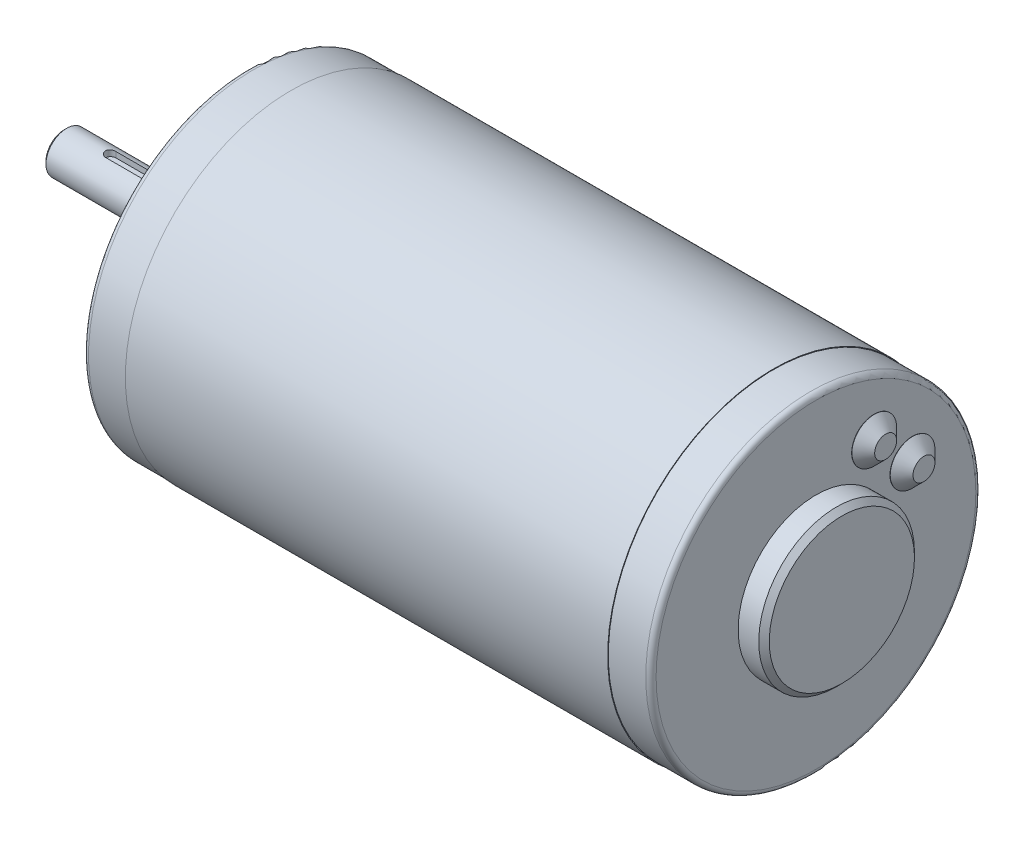
ISO-10303-21;
HEADER;
FILE_DESCRIPTION(('STEP AP214'),'2;1');
FILE_NAME('part.step','',(''),(''),'','','');
FILE_SCHEMA(('AUTOMOTIVE_DESIGN { 1 0 10303 214 1 1 1 1 }'));
ENDSEC;
DATA;
#1=APPLICATION_CONTEXT('core data for automotive mechanical design processes');
#2=APPLICATION_PROTOCOL_DEFINITION('international standard','automotive_design',2000,#1);
#3=PRODUCT_CONTEXT('',#1,'mechanical');
#4=PRODUCT('Part','Part','',(#3));
#5=PRODUCT_RELATED_PRODUCT_CATEGORY('part','',(#4));
#6=PRODUCT_DEFINITION_FORMATION('','',#4);
#7=PRODUCT_DEFINITION_CONTEXT('part definition',#1,'design');
#8=PRODUCT_DEFINITION('design','',#6,#7);
#9=PRODUCT_DEFINITION_SHAPE('','',#8);
#10=(LENGTH_UNIT() NAMED_UNIT(*) SI_UNIT(.MILLI.,.METRE.));
#11=(NAMED_UNIT(*) PLANE_ANGLE_UNIT() SI_UNIT($,.RADIAN.));
#12=(NAMED_UNIT(*) SI_UNIT($,.STERADIAN.) SOLID_ANGLE_UNIT());
#13=UNCERTAINTY_MEASURE_WITH_UNIT(LENGTH_MEASURE(1.E-05),#10,'distance_accuracy_value','');
#14=(GEOMETRIC_REPRESENTATION_CONTEXT(3) GLOBAL_UNCERTAINTY_ASSIGNED_CONTEXT((#13)) GLOBAL_UNIT_ASSIGNED_CONTEXT((#10,
#11,#12)) REPRESENTATION_CONTEXT('',''));
#15=CARTESIAN_POINT('',(0.,0.,0.));
#16=DIRECTION('',(0.,0.,1.));
#17=DIRECTION('',(1.,0.,0.));
#18=AXIS2_PLACEMENT_3D('',#15,#16,#17);
#19=CARTESIAN_POINT('',(-27.6,2.79999999999999,-1.));
#20=DIRECTION('',(0.,-1.,0.));
#21=DIRECTION('',(0.,0.,-1.));
#22=AXIS2_PLACEMENT_3D('',#19,#20,#21);
#23=PLANE('',#22);
#24=CARTESIAN_POINT('',(-7.1,2.79999999999999,0.));
#25=DIRECTION('',(0.,1.,0.));
#26=DIRECTION('',(0.,0.,1.));
#27=AXIS2_PLACEMENT_3D('',#24,#25,#26);
#28=CIRCLE('',#27,1.);
#29=CARTESIAN_POINT('',(-7.1,2.79999999999999,1.));
#30=VERTEX_POINT('',#29);
#31=CARTESIAN_POINT('',(-7.1,2.79999999999999,-1.));
#32=VERTEX_POINT('',#31);
#33=EDGE_CURVE('E79',#30,#32,#28,.T.);
#34=ORIENTED_EDGE('',*,*,#33,.T.);
#35=DIRECTION('',(1.,0.,0.));
#36=VECTOR('',#35,1.);
#37=CARTESIAN_POINT('',(-27.6,2.79999999999999,-1.));
#38=LINE('',#37,#36);
#39=CARTESIAN_POINT('',(-26.6,2.79999999999999,-1.));
#40=VERTEX_POINT('',#39);
#41=EDGE_CURVE('E74',#40,#32,#38,.T.);
#42=ORIENTED_EDGE('',*,*,#41,.F.);
#43=CARTESIAN_POINT('',(-26.6,2.79999999999999,0.));
#44=DIRECTION('',(0.,-1.,0.));
#45=DIRECTION('',(0.,0.,-1.));
#46=AXIS2_PLACEMENT_3D('',#43,#44,#45);
#47=CIRCLE('',#46,1.);
#48=CARTESIAN_POINT('',(-26.6,2.79999999999999,1.));
#49=VERTEX_POINT('',#48);
#50=EDGE_CURVE('E76',#40,#49,#47,.F.);
#51=ORIENTED_EDGE('',*,*,#50,.T.);
#52=DIRECTION('',(1.,0.,0.));
#53=VECTOR('',#52,1.);
#54=CARTESIAN_POINT('',(-27.6,2.79999999999999,1.));
#55=LINE('',#54,#53);
#56=EDGE_CURVE('E102',#49,#30,#55,.T.);
#57=ORIENTED_EDGE('',*,*,#56,.T.);
#58=EDGE_LOOP('',(#34,#42,#51,#57));
#59=FACE_BOUND('',#58,.T.);
#60=ADVANCED_FACE('F16',(#59),#23,.F.);
#61=CARTESIAN_POINT('',(-35.6,0.,0.));
#62=DIRECTION('',(-1.,0.,0.));
#63=DIRECTION('',(0.,0.,1.));
#64=AXIS2_PLACEMENT_3D('',#61,#62,#63);
#65=PLANE('',#64);
#66=CARTESIAN_POINT('',(-35.6000000000449,0.,0.));
#67=DIRECTION('',(1.,0.,0.));
#68=DIRECTION('',(0.,0.,-1.));
#69=AXIS2_PLACEMENT_3D('',#66,#67,#68);
#70=CIRCLE('',#69,3.49999999997408);
#71=CARTESIAN_POINT('',(-35.6000000000449,0.,-3.49999999997408));
#72=VERTEX_POINT('',#71);
#73=EDGE_CURVE('E324',#72,#72,#70,.T.);
#74=ORIENTED_EDGE('',*,*,#73,.F.);
#75=EDGE_LOOP('',(#74));
#76=FACE_BOUND('',#75,.T.);
#77=ADVANCED_FACE('F575',(#76),#65,.T.);
#78=CARTESIAN_POINT('',(-26.6,3.87298334620741,0.));
#79=DIRECTION('',(0.,-1.,0.));
#80=DIRECTION('',(0.,0.,-1.));
#81=AXIS2_PLACEMENT_3D('',#78,#79,#80);
#82=CYLINDRICAL_SURFACE('',#81,1.);
#83=CARTESIAN_POINT('',(-26.6,3.87298334620741,1.));
#84=CARTESIAN_POINT('',(-26.6276629851065,3.87298148580177,1.00000033749611));
#85=CARTESIAN_POINT('',(-26.6553122630182,3.8732800994947,0.998851407375366));
#86=CARTESIAN_POINT('',(-26.7104040353036,3.87445904774558,0.994271295395754));
#87=CARTESIAN_POINT('',(-26.7378465636871,3.87533928441687,0.990840497572679));
#88=CARTESIAN_POINT('',(-26.8194531732088,3.87881710972053,0.977175239382526));
#89=CARTESIAN_POINT('',(-26.8730564684822,3.88225203148808,0.963567695172493));
#90=CARTESIAN_POINT('',(-26.977124673782,3.89095422588002,0.927798076247996));
#91=CARTESIAN_POINT('',(-27.0275898782129,3.89622132630929,0.905636805423835));
#92=CARTESIAN_POINT('',(-27.1241114486473,3.90799134471939,0.853415378025864));
#93=CARTESIAN_POINT('',(-27.170166627891,3.91449459395647,0.823353103356932));
#94=CARTESIAN_POINT('',(-27.2575438819061,3.92816262398025,0.755484471828069));
#95=CARTESIAN_POINT('',(-27.2987548862455,3.93533791028915,0.717537268783975));
#96=CARTESIAN_POINT('',(-27.3743020894827,3.94945104396193,0.635275780516229));
#97=CARTESIAN_POINT('',(-27.4086371894679,3.95638885322537,0.59096047947883));
#98=CARTESIAN_POINT('',(-27.4699110016186,3.96936182283248,0.496456899401689));
#99=CARTESIAN_POINT('',(-27.496739895984,3.9753830468173,0.446195340334472));
#100=CARTESIAN_POINT('',(-27.5415247341967,3.98572346250588,0.341702590842916));
#101=CARTESIAN_POINT('',(-27.5594824242998,3.990042989147,0.287472184083007));
#102=CARTESIAN_POINT('',(-27.5856589927774,3.99641900005128,0.177744108525158));
#103=CARTESIAN_POINT('',(-27.5940676724228,3.998519529013,0.122294322002856));
#104=CARTESIAN_POINT('',(-27.6015033715433,4.00037438150815,0.0107327756816781));
#105=CARTESIAN_POINT('',(-27.6005315701923,4.00012899993444,-0.0453789000287067));
#106=CARTESIAN_POINT('',(-27.5893700363146,3.99735237365735,-0.155352492972096));
#107=CARTESIAN_POINT('',(-27.5793853834005,3.9948719867736,-0.209236701739855));
#108=CARTESIAN_POINT('',(-27.5508113208173,3.98796330636495,-0.31453871108434));
#109=CARTESIAN_POINT('',(-27.5322215304314,3.98353492665556,-0.365956402423988));
#110=CARTESIAN_POINT('',(-27.4867987193294,3.97314997761798,-0.46540728602454));
#111=CARTESIAN_POINT('',(-27.4598926057672,3.96717993827555,-0.513405629602248));
#112=CARTESIAN_POINT('',(-27.3986568701665,3.95435945541919,-0.604276631230015));
#113=CARTESIAN_POINT('',(-27.3643261297468,3.94750887933198,-0.64714851556229));
#114=CARTESIAN_POINT('',(-27.2881210879187,3.93345566022865,-0.727769389708492));
#115=CARTESIAN_POINT('',(-27.2460683634602,3.92624850477685,-0.765349103054128));
#116=CARTESIAN_POINT('',(-27.1561701330723,3.91246168284006,-0.832969575186237));
#117=CARTESIAN_POINT('',(-27.1083230467164,3.90588218842993,-0.863008270245062));
#118=CARTESIAN_POINT('',(-27.0078544021762,3.89407813586325,-0.914804709285961));
#119=CARTESIAN_POINT('',(-26.9552085351039,3.88886106009136,-0.936517017887269));
#120=CARTESIAN_POINT('',(-26.8468830715817,3.88047058807054,-0.970702351849828));
#121=CARTESIAN_POINT('',(-26.7912081448502,3.87729413761435,-0.983189189212131));
#122=CARTESIAN_POINT('',(-26.7125426192411,3.87455290681524,-0.993904635150938));
#123=CARTESIAN_POINT('',(-26.6900802967868,3.87396523110859,-0.996190790966708));
#124=CARTESIAN_POINT('',(-26.6450822100907,3.87318062488974,-0.999236757697394));
#125=CARTESIAN_POINT('',(-26.6225466240447,3.87298306219461,-0.999999038096045));
#126=CARTESIAN_POINT('',(-26.6,3.87298334620741,-1.));
#127=B_SPLINE_CURVE_WITH_KNOTS('',3,(#83,#84,#85,#86,#87,#88,#89,#90,#91,#92,#93,#94,#95,#96,
#97,#98,#99,#100,#101,#102,#103,#104,#105,#106,#107,#108,#109,#110,#111,#112,#113,#114,#115,
#116,#117,#118,#119,#120,#121,#122,#123,#124,#125,#126),.UNSPECIFIED.,.F.,.F.,(4,2,2,2,2,2,2,2,
2,2,2,2,2,2,2,2,2,2,2,2,2,4),(0.,0.0829365303397727,0.165859106084653,0.331229963080318,
0.496585282091499,0.661984974726751,0.830641897427976,0.999325753539196,1.17036187098235,
1.34136430732425,1.50890481515325,1.67642426256639,1.84022545479276,2.00403389475838,
2.16932509450376,2.33464120964329,2.50441429534542,2.67423379180967,2.84496720161068,
3.01544447539986,3.08315848722649,3.15076267731671),.UNSPECIFIED.);
#128=CARTESIAN_POINT('',(-26.6,3.87298334620741,1.));
#129=VERTEX_POINT('',#128);
#130=CARTESIAN_POINT('',(-26.6,3.87298334620741,-1.));
#131=VERTEX_POINT('',#130);
#132=EDGE_CURVE('E160',#129,#131,#127,.T.);
#133=ORIENTED_EDGE('',*,*,#132,.F.);
#134=DIRECTION('',(0.,1.,0.));
#135=VECTOR('',#134,1.);
#136=CARTESIAN_POINT('',(-26.6,2.79999999999999,1.));
#137=LINE('',#136,#135);
#138=EDGE_CURVE('E89',#129,#49,#137,.F.);
#139=ORIENTED_EDGE('',*,*,#138,.T.);
#140=ORIENTED_EDGE('',*,*,#50,.F.);
#141=DIRECTION('',(0.,1.,0.));
#142=VECTOR('',#141,1.);
#143=CARTESIAN_POINT('',(-26.6,2.79999999999999,-1.));
#144=LINE('',#143,#142);
#145=EDGE_CURVE('E83',#131,#40,#144,.F.);
#146=ORIENTED_EDGE('',*,*,#145,.F.);
#147=EDGE_LOOP('',(#133,#139,#140,#146));
#148=FACE_BOUND('',#147,.T.);
#149=ADVANCED_FACE('F86',(#148),#82,.F.);
#150=CARTESIAN_POINT('',(-27.6,2.79999999999999,-1.));
#151=DIRECTION('',(0.,0.,1.));
#152=DIRECTION('',(1.,0.,0.));
#153=AXIS2_PLACEMENT_3D('',#150,#151,#152);
#154=PLANE('',#153);
#155=DIRECTION('',(1.,0.,0.));
#156=VECTOR('',#155,1.);
#157=CARTESIAN_POINT('',(0.,3.87298334620741,-1.));
#158=LINE('',#157,#156);
#159=CARTESIAN_POINT('',(-7.1,3.87298334620741,-1.));
#160=VERTEX_POINT('',#159);
#161=EDGE_CURVE('E94',#131,#160,#158,.T.);
#162=ORIENTED_EDGE('',*,*,#161,.F.);
#163=ORIENTED_EDGE('',*,*,#145,.T.);
#164=ORIENTED_EDGE('',*,*,#41,.T.);
#165=DIRECTION('',(0.,1.,0.));
#166=VECTOR('',#165,1.);
#167=CARTESIAN_POINT('',(-7.1,2.79999999999999,-1.));
#168=LINE('',#167,#166);
#169=EDGE_CURVE('E97',#32,#160,#168,.T.);
#170=ORIENTED_EDGE('',*,*,#169,.T.);
#171=EDGE_LOOP('',(#162,#163,#164,#170));
#172=FACE_BOUND('',#171,.T.);
#173=ADVANCED_FACE('F92',(#172),#154,.T.);
#174=CARTESIAN_POINT('',(-7.1,2.79999999999999,0.));
#175=DIRECTION('',(0.,1.,0.));
#176=DIRECTION('',(0.,0.,1.));
#177=AXIS2_PLACEMENT_3D('',#174,#175,#176);
#178=CYLINDRICAL_SURFACE('',#177,1.);
#179=ORIENTED_EDGE('',*,*,#33,.F.);
#180=DIRECTION('',(0.,1.,0.));
#181=VECTOR('',#180,1.);
#182=CARTESIAN_POINT('',(-7.1,2.79999999999999,1.));
#183=LINE('',#182,#181);
#184=CARTESIAN_POINT('',(-7.1,3.87298334620741,1.));
#185=VERTEX_POINT('',#184);
#186=EDGE_CURVE('E103',#30,#185,#183,.T.);
#187=ORIENTED_EDGE('',*,*,#186,.T.);
#188=CARTESIAN_POINT('',(-7.1,3.87298334620741,-1.));
#189=CARTESIAN_POINT('',(-7.07233701489346,3.87298148580177,-1.00000033749611));
#190=CARTESIAN_POINT('',(-7.04468773698177,3.8732800994947,-0.998851407375366));
#191=CARTESIAN_POINT('',(-6.98959596469644,3.87445904774558,-0.994271295395754));
#192=CARTESIAN_POINT('',(-6.96215343631291,3.87533928441687,-0.990840497572679));
#193=CARTESIAN_POINT('',(-6.88054682679116,3.87881710972053,-0.977175239382526));
#194=CARTESIAN_POINT('',(-6.82694353151779,3.88225203148808,-0.963567695172493));
#195=CARTESIAN_POINT('',(-6.72287532621804,3.89095422588002,-0.927798076247997));
#196=CARTESIAN_POINT('',(-6.67241012178714,3.89622132630929,-0.905636805423836));
#197=CARTESIAN_POINT('',(-6.57588855135267,3.90799134471939,-0.853415378025865));
#198=CARTESIAN_POINT('',(-6.52983337210904,3.91449459395647,-0.823353103356933));
#199=CARTESIAN_POINT('',(-6.4424561180939,3.92816262398025,-0.755484471828069));
#200=CARTESIAN_POINT('',(-6.40124511375448,3.93533791028915,-0.717537268783976));
#201=CARTESIAN_POINT('',(-6.32569791051729,3.94945104396193,-0.63527578051623));
#202=CARTESIAN_POINT('',(-6.29136281053206,3.95638885322537,-0.590960479478831));
#203=CARTESIAN_POINT('',(-6.23008899838136,3.96936182283248,-0.496456899401691));
#204=CARTESIAN_POINT('',(-6.20326010401603,3.9753830468173,-0.446195340334474));
#205=CARTESIAN_POINT('',(-6.1584752658033,3.98572346250588,-0.341702590842919));
#206=CARTESIAN_POINT('',(-6.14051757570017,3.990042989147,-0.28747218408301));
#207=CARTESIAN_POINT('',(-6.11434100722257,3.99641900005128,-0.17774410852516));
#208=CARTESIAN_POINT('',(-6.10593232757718,3.998519529013,-0.122294322002858));
#209=CARTESIAN_POINT('',(-6.09849662845671,4.00037438150815,-0.0107327756816796));
#210=CARTESIAN_POINT('',(-6.09946842980766,4.00012899993444,0.0453789000287057));
#211=CARTESIAN_POINT('',(-6.11062996368545,3.99735237365735,0.155352492972096));
#212=CARTESIAN_POINT('',(-6.12061461659948,3.9948719867736,0.209236701739855));
#213=CARTESIAN_POINT('',(-6.14918867918275,3.98796330636495,0.31453871108434));
#214=CARTESIAN_POINT('',(-6.16777846956858,3.98353492665556,0.365956402423988));
#215=CARTESIAN_POINT('',(-6.21320128067065,3.97314997761798,0.465407286024539));
#216=CARTESIAN_POINT('',(-6.24010739423284,3.96717993827555,0.513405629602248));
#217=CARTESIAN_POINT('',(-6.30134312983347,3.95435945541919,0.604276631230014));
#218=CARTESIAN_POINT('',(-6.33567387025322,3.94750887933198,0.647148515562289));
#219=CARTESIAN_POINT('',(-6.41187891208131,3.93345566022865,0.72776938970849));
#220=CARTESIAN_POINT('',(-6.45393163653981,3.92624850477685,0.765349103054127));
#221=CARTESIAN_POINT('',(-6.54382986692773,3.91246168284006,0.832969575186237));
#222=CARTESIAN_POINT('',(-6.59167695328356,3.90588218842993,0.863008270245062));
#223=CARTESIAN_POINT('',(-6.69214559782377,3.89407813586325,0.914804709285962));
#224=CARTESIAN_POINT('',(-6.74479146489609,3.88886106009136,0.936517017887269));
#225=CARTESIAN_POINT('',(-6.85311692841829,3.88047058807055,0.970702351849829));
#226=CARTESIAN_POINT('',(-6.90879185514984,3.87729413761435,0.983189189212132));
#227=CARTESIAN_POINT('',(-6.9874573807589,3.87455290681524,0.993904635150938));
#228=CARTESIAN_POINT('',(-7.00991970321318,3.87396523110859,0.996190790966708));
#229=CARTESIAN_POINT('',(-7.05491778990932,3.87318062488974,0.999236757697394));
#230=CARTESIAN_POINT('',(-7.07745337595529,3.87298306219461,0.999999038096045));
#231=CARTESIAN_POINT('',(-7.1,3.87298334620741,1.));
#232=B_SPLINE_CURVE_WITH_KNOTS('',3,(#188,#189,#190,#191,#192,#193,#194,#195,#196,#197,#198,
#199,#200,#201,#202,#203,#204,#205,#206,#207,#208,#209,#210,#211,#212,#213,#214,#215,#216,#217,
#218,#219,#220,#221,#222,#223,#224,#225,#226,#227,#228,#229,#230,#231),.UNSPECIFIED.,.F.,.F.,(4,
2,2,2,2,2,2,2,2,2,2,2,2,2,2,2,2,2,2,2,2,4),(0.,0.0829365303397693,0.165859106084651,
0.331229963080317,0.496585282091498,0.661984974726749,0.830641897427974,0.999325753539193,
1.17036187098235,1.34136430732424,1.50890481515325,1.67642426256639,1.84022545479276,
2.00403389475838,2.16932509450376,2.33464120964329,2.50441429534542,2.67423379180967,
2.84496720161068,3.01544447539986,3.08315848722648,3.15076267731671),.UNSPECIFIED.);
#233=EDGE_CURVE('E151',#160,#185,#232,.T.);
#234=ORIENTED_EDGE('',*,*,#233,.F.);
#235=ORIENTED_EDGE('',*,*,#169,.F.);
#236=EDGE_LOOP('',(#179,#187,#234,#235));
#237=FACE_BOUND('',#236,.T.);
#238=ADVANCED_FACE('F166',(#237),#178,.F.);
#239=CARTESIAN_POINT('',(-27.6,2.79999999999999,1.));
#240=DIRECTION('',(0.,0.,1.));
#241=DIRECTION('',(1.,0.,0.));
#242=AXIS2_PLACEMENT_3D('',#239,#240,#241);
#243=PLANE('',#242);
#244=ORIENTED_EDGE('',*,*,#186,.F.);
#245=ORIENTED_EDGE('',*,*,#56,.F.);
#246=ORIENTED_EDGE('',*,*,#138,.F.);
#247=DIRECTION('',(1.,0.,0.));
#248=VECTOR('',#247,1.);
#249=CARTESIAN_POINT('',(0.,3.87298334620741,1.));
#250=LINE('',#249,#248);
#251=EDGE_CURVE('E159',#185,#129,#250,.F.);
#252=ORIENTED_EDGE('',*,*,#251,.F.);
#253=EDGE_LOOP('',(#244,#245,#246,#252));
#254=FACE_BOUND('',#253,.T.);
#255=ADVANCED_FACE('F181',(#254),#243,.F.);
#256=CARTESIAN_POINT('',(-35.0999999999999,0.,0.));
#257=DIRECTION('',(1.,0.,0.));
#258=DIRECTION('',(0.,0.,-1.));
#259=AXIS2_PLACEMENT_3D('',#256,#257,#258);
#260=CONICAL_SURFACE('',#259,3.99999999996226,0.785398163340605);
#261=ORIENTED_EDGE('',*,*,#73,.T.);
#262=EDGE_LOOP('',(#261));
#263=FACE_BOUND('',#262,.T.);
#264=CARTESIAN_POINT('',(-35.1,0.,0.));
#265=DIRECTION('',(1.,0.,0.));
#266=DIRECTION('',(0.,0.,-1.));
#267=AXIS2_PLACEMENT_3D('',#264,#265,#266);
#268=CIRCLE('',#267,4.);
#269=CARTESIAN_POINT('',(-35.1,0.,-4.));
#270=VERTEX_POINT('',#269);
#271=EDGE_CURVE('E150',#270,#270,#268,.T.);
#272=ORIENTED_EDGE('',*,*,#271,.F.);
#273=EDGE_LOOP('',(#272));
#274=FACE_BOUND('',#273,.T.);
#275=ADVANCED_FACE('F176',(#263,#274),#260,.T.);
#276=CARTESIAN_POINT('',(0.,0.,0.));
#277=DIRECTION('',(1.,0.,0.));
#278=DIRECTION('',(0.,0.,-1.));
#279=AXIS2_PLACEMENT_3D('',#276,#277,#278);
#280=CYLINDRICAL_SURFACE('',#279,4.);
#281=ORIENTED_EDGE('',*,*,#271,.T.);
#282=EDGE_LOOP('',(#281));
#283=FACE_BOUND('',#282,.T.);
#284=CARTESIAN_POINT('',(-4.,0.,0.));
#285=DIRECTION('',(1.,0.,0.));
#286=DIRECTION('',(0.,0.,-1.));
#287=AXIS2_PLACEMENT_3D('',#284,#285,#286);
#288=CIRCLE('',#287,4.);
#289=CARTESIAN_POINT('',(-4.,0.,-4.));
#290=VERTEX_POINT('',#289);
#291=EDGE_CURVE('E147',#290,#290,#288,.T.);
#292=ORIENTED_EDGE('',*,*,#291,.F.);
#293=EDGE_LOOP('',(#292));
#294=FACE_BOUND('',#293,.T.);
#295=ORIENTED_EDGE('',*,*,#233,.T.);
#296=ORIENTED_EDGE('',*,*,#251,.T.);
#297=ORIENTED_EDGE('',*,*,#132,.T.);
#298=ORIENTED_EDGE('',*,*,#161,.T.);
#299=EDGE_LOOP('',(#295,#296,#297,#298));
#300=FACE_BOUND('',#299,.T.);
#301=ADVANCED_FACE('F170',(#283,#294,#300),#280,.T.);
#302=CARTESIAN_POINT('',(-4.,4.,0.));
#303=DIRECTION('',(-1.,0.,0.));
#304=DIRECTION('',(0.,0.,1.));
#305=AXIS2_PLACEMENT_3D('',#302,#303,#304);
#306=PLANE('',#305);
#307=ORIENTED_EDGE('',*,*,#291,.T.);
#308=EDGE_LOOP('',(#307));
#309=FACE_BOUND('',#308,.T.);
#310=CARTESIAN_POINT('',(-4.,0.,0.));
#311=DIRECTION('',(1.,0.,0.));
#312=DIRECTION('',(0.,1.,0.));
#313=AXIS2_PLACEMENT_3D('',#310,#311,#312);
#314=CIRCLE('',#313,8.509);
#315=CARTESIAN_POINT('',(-4.,8.509,0.));
#316=VERTEX_POINT('',#315);
#317=EDGE_CURVE('E144',#316,#316,#314,.T.);
#318=ORIENTED_EDGE('',*,*,#317,.F.);
#319=EDGE_LOOP('',(#318));
#320=FACE_BOUND('',#319,.T.);
#321=ADVANCED_FACE('F175',(#309,#320),#306,.T.);
#322=CARTESIAN_POINT('',(111.8479,18.6070906828553,-11.2073596390943));
#323=DIRECTION('',(1.,0.,0.));
#324=DIRECTION('',(0.,0.,-1.));
#325=AXIS2_PLACEMENT_3D('',#322,#323,#324);
#326=PLANE('',#325);
#327=CARTESIAN_POINT('',(111.84789999993,18.6070906828553,-11.2073596390943));
#328=DIRECTION('',(-1.,0.,0.));
#329=DIRECTION('',(0.,-1.,0.));
#330=AXIS2_PLACEMENT_3D('',#327,#328,#329);
#331=CIRCLE('',#330,2.11800000003146);
#332=CARTESIAN_POINT('',(111.84789999993,16.4890906828238,-11.2073596390943));
#333=VERTEX_POINT('',#332);
#334=EDGE_CURVE('E141',#333,#333,#331,.T.);
#335=ORIENTED_EDGE('',*,*,#334,.F.);
#336=EDGE_LOOP('',(#335));
#337=FACE_BOUND('',#336,.T.);
#338=ADVANCED_FACE('F527',(#337),#326,.T.);
#339=CARTESIAN_POINT('',(114.6,15.0368,0.));
#340=DIRECTION('',(1.,0.,0.));
#341=DIRECTION('',(0.,0.,-1.));
#342=AXIS2_PLACEMENT_3D('',#339,#340,#341);
#343=PLANE('',#342);
#344=CARTESIAN_POINT('',(114.6,0.,0.));
#345=DIRECTION('',(-1.,0.,0.));
#346=DIRECTION('',(0.,-1.,0.));
#347=AXIS2_PLACEMENT_3D('',#344,#345,#346);
#348=CIRCLE('',#347,14.0208);
#349=CARTESIAN_POINT('',(114.6,-14.0208,0.));
#350=VERTEX_POINT('',#349);
#351=EDGE_CURVE('E138',#350,#350,#348,.T.);
#352=ORIENTED_EDGE('',*,*,#351,.F.);
#353=EDGE_LOOP('',(#352));
#354=FACE_BOUND('',#353,.T.);
#355=ADVANCED_FACE('F518',(#354),#343,.T.);
#356=CARTESIAN_POINT('',(111.8479,11.2073596390943,-18.6070906828553));
#357=DIRECTION('',(1.,0.,0.));
#358=DIRECTION('',(0.,0.,-1.));
#359=AXIS2_PLACEMENT_3D('',#356,#357,#358);
#360=PLANE('',#359);
#361=CARTESIAN_POINT('',(111.84789999993,11.2073596390943,-18.6070906828553));
#362=DIRECTION('',(-1.,0.,0.));
#363=DIRECTION('',(0.,0.,1.));
#364=AXIS2_PLACEMENT_3D('',#361,#362,#363);
#365=CIRCLE('',#364,2.1180000000021);
#366=CARTESIAN_POINT('',(111.84789999993,11.2073596390943,-16.4890906828532));
#367=VERTEX_POINT('',#366);
#368=EDGE_CURVE('E134',#367,#367,#365,.T.);
#369=ORIENTED_EDGE('',*,*,#368,.F.);
#370=EDGE_LOOP('',(#369));
#371=FACE_BOUND('',#370,.T.);
#372=ADVANCED_FACE('F509',(#371),#360,.T.);
#373=CARTESIAN_POINT('',(13.6143999999945,25.4,0.));
#374=DIRECTION('',(-1.,0.,0.));
#375=DIRECTION('',(0.,0.,1.));
#376=AXIS2_PLACEMENT_3D('',#373,#374,#375);
#377=CONICAL_SURFACE('',#376,2.01929999997219,1.02974425867198);
#378=CARTESIAN_POINT('',(14.827717847993,25.4,0.));
#379=VERTEX_POINT('',#378);
#380=VERTEX_LOOP('',#379);
#381=FACE_BOUND('',#380,.T.);
#382=CARTESIAN_POINT('',(13.6144,25.4,0.));
#383=DIRECTION('',(-1.,0.,0.));
#384=DIRECTION('',(0.,0.,1.));
#385=AXIS2_PLACEMENT_3D('',#382,#383,#384);
#386=CIRCLE('',#385,2.0193);
#387=CARTESIAN_POINT('',(13.6144,25.4,2.0193));
#388=VERTEX_POINT('',#387);
#389=EDGE_CURVE('E137',#388,#388,#386,.T.);
#390=ORIENTED_EDGE('',*,*,#389,.T.);
#391=EDGE_LOOP('',(#390));
#392=FACE_BOUND('',#391,.T.);
#393=ADVANCED_FACE('F500',(#381,#392),#377,.F.);
#394=CARTESIAN_POINT('',(13.6143999999945,-25.4,0.));
#395=DIRECTION('',(-1.,0.,0.));
#396=DIRECTION('',(0.,0.,1.));
#397=AXIS2_PLACEMENT_3D('',#394,#395,#396);
#398=CONICAL_SURFACE('',#397,2.01929999997219,1.02974425867198);
#399=CARTESIAN_POINT('',(14.827717847993,-25.4,0.));
#400=VERTEX_POINT('',#399);
#401=VERTEX_LOOP('',#400);
#402=FACE_BOUND('',#401,.T.);
#403=CARTESIAN_POINT('',(13.6144,-25.4,0.));
#404=DIRECTION('',(-1.,0.,0.));
#405=DIRECTION('',(0.,0.,1.));
#406=AXIS2_PLACEMENT_3D('',#403,#404,#405);
#407=CIRCLE('',#406,2.0193);
#408=CARTESIAN_POINT('',(13.6144,-25.4,2.0193));
#409=VERTEX_POINT('',#408);
#410=EDGE_CURVE('E314',#409,#409,#407,.T.);
#411=ORIENTED_EDGE('',*,*,#410,.T.);
#412=EDGE_LOOP('',(#411));
#413=FACE_BOUND('',#412,.T.);
#414=ADVANCED_FACE('F491',(#402,#413),#398,.F.);
#415=CARTESIAN_POINT('',(-2.984,0.,0.));
#416=DIRECTION('',(1.,0.,0.));
#417=DIRECTION('',(0.,1.,0.));
#418=AXIS2_PLACEMENT_3D('',#415,#416,#417);
#419=CONICAL_SURFACE('',#418,9.525,0.78539816339745);
#420=ORIENTED_EDGE('',*,*,#317,.T.);
#421=EDGE_LOOP('',(#420));
#422=FACE_BOUND('',#421,.T.);
#423=CARTESIAN_POINT('',(-2.984,0.,0.));
#424=DIRECTION('',(1.,0.,0.));
#425=DIRECTION('',(0.,0.,-1.));
#426=AXIS2_PLACEMENT_3D('',#423,#424,#425);
#427=CIRCLE('',#426,9.525);
#428=CARTESIAN_POINT('',(-2.984,0.,-9.525));
#429=VERTEX_POINT('',#428);
#430=EDGE_CURVE('E311',#429,#429,#427,.T.);
#431=ORIENTED_EDGE('',*,*,#430,.F.);
#432=EDGE_LOOP('',(#431));
#433=FACE_BOUND('',#432,.T.);
#434=ADVANCED_FACE('F482',(#422,#433),#419,.T.);
#435=CARTESIAN_POINT('',(109.647900000027,18.6070906828553,-11.2073596390943));
#436=DIRECTION('',(-1.,0.,0.));
#437=DIRECTION('',(0.,-1.,0.));
#438=AXIS2_PLACEMENT_3D('',#435,#436,#437);
#439=CONICAL_SURFACE('',#438,4.31799999987712,0.785398163384529);
#440=CARTESIAN_POINT('',(109.6479,18.6070906828553,-11.2073596390943));
#441=DIRECTION('',(-1.,0.,0.));
#442=DIRECTION('',(0.,0.,1.));
#443=AXIS2_PLACEMENT_3D('',#440,#441,#442);
#444=CIRCLE('',#443,4.318);
#445=CARTESIAN_POINT('',(109.6479,18.6070906828553,-6.88935963909434));
#446=VERTEX_POINT('',#445);
#447=EDGE_CURVE('E308',#446,#446,#444,.T.);
#448=ORIENTED_EDGE('',*,*,#447,.F.);
#449=EDGE_LOOP('',(#448));
#450=FACE_BOUND('',#449,.T.);
#451=ORIENTED_EDGE('',*,*,#334,.T.);
#452=EDGE_LOOP('',(#451));
#453=FACE_BOUND('',#452,.T.);
#454=ADVANCED_FACE('F473',(#450,#453),#439,.T.);
#455=CARTESIAN_POINT('',(113.584,0.,0.));
#456=DIRECTION('',(-1.,0.,0.));
#457=DIRECTION('',(0.,-1.,0.));
#458=AXIS2_PLACEMENT_3D('',#455,#456,#457);
#459=CONICAL_SURFACE('',#458,15.0368,0.785398163397441);
#460=ORIENTED_EDGE('',*,*,#351,.T.);
#461=EDGE_LOOP('',(#460));
#462=FACE_BOUND('',#461,.T.);
#463=CARTESIAN_POINT('',(113.584,0.,0.));
#464=DIRECTION('',(1.,0.,0.));
#465=DIRECTION('',(0.,0.,-1.));
#466=AXIS2_PLACEMENT_3D('',#463,#464,#465);
#467=CIRCLE('',#466,15.0368);
#468=CARTESIAN_POINT('',(113.584,0.,-15.0368));
#469=VERTEX_POINT('',#468);
#470=EDGE_CURVE('E305',#469,#469,#467,.F.);
#471=ORIENTED_EDGE('',*,*,#470,.F.);
#472=EDGE_LOOP('',(#471));
#473=FACE_BOUND('',#472,.T.);
#474=ADVANCED_FACE('F464',(#462,#473),#459,.T.);
#475=CARTESIAN_POINT('',(109.647900000084,11.2073596390943,-18.6070906828553));
#476=DIRECTION('',(-1.,0.,0.));
#477=DIRECTION('',(0.,0.,1.));
#478=AXIS2_PLACEMENT_3D('',#475,#476,#477);
#479=CONICAL_SURFACE('',#478,4.31799999990461,0.785398163410367);
#480=CARTESIAN_POINT('',(109.6479,11.2073596390943,-18.6070906828553));
#481=DIRECTION('',(-1.,0.,0.));
#482=DIRECTION('',(0.,0.,1.));
#483=AXIS2_PLACEMENT_3D('',#480,#481,#482);
#484=CIRCLE('',#483,4.318);
#485=CARTESIAN_POINT('',(109.6479,11.2073596390943,-14.2890906828553));
#486=VERTEX_POINT('',#485);
#487=EDGE_CURVE('E133',#486,#486,#484,.T.);
#488=ORIENTED_EDGE('',*,*,#487,.F.);
#489=EDGE_LOOP('',(#488));
#490=FACE_BOUND('',#489,.T.);
#491=ORIENTED_EDGE('',*,*,#368,.T.);
#492=EDGE_LOOP('',(#491));
#493=FACE_BOUND('',#492,.T.);
#494=ADVANCED_FACE('F455',(#490,#493),#479,.T.);
#495=CARTESIAN_POINT('',(0.,25.4,0.));
#496=DIRECTION('',(-1.,0.,0.));
#497=DIRECTION('',(0.,0.,1.));
#498=AXIS2_PLACEMENT_3D('',#495,#496,#497);
#499=CYLINDRICAL_SURFACE('',#498,2.0193);
#500=CARTESIAN_POINT('',(0.,25.4,0.));
#501=DIRECTION('',(-1.,0.,0.));
#502=DIRECTION('',(0.,0.,1.));
#503=AXIS2_PLACEMENT_3D('',#500,#501,#502);
#504=CIRCLE('',#503,2.0193);
#505=CARTESIAN_POINT('',(0.,25.4,2.0193));
#506=VERTEX_POINT('',#505);
#507=EDGE_CURVE('E130',#506,#506,#504,.F.);
#508=ORIENTED_EDGE('',*,*,#507,.F.);
#509=EDGE_LOOP('',(#508));
#510=FACE_BOUND('',#509,.T.);
#511=ORIENTED_EDGE('',*,*,#389,.F.);
#512=EDGE_LOOP('',(#511));
#513=FACE_BOUND('',#512,.T.);
#514=ADVANCED_FACE('F446',(#510,#513),#499,.F.);
#515=CARTESIAN_POINT('',(0.,-25.4,0.));
#516=DIRECTION('',(-1.,0.,0.));
#517=DIRECTION('',(0.,0.,1.));
#518=AXIS2_PLACEMENT_3D('',#515,#516,#517);
#519=CYLINDRICAL_SURFACE('',#518,2.0193);
#520=CARTESIAN_POINT('',(0.,-25.4,0.));
#521=DIRECTION('',(-1.,0.,0.));
#522=DIRECTION('',(0.,0.,1.));
#523=AXIS2_PLACEMENT_3D('',#520,#521,#522);
#524=CIRCLE('',#523,2.0193);
#525=CARTESIAN_POINT('',(0.,-25.4,2.0193));
#526=VERTEX_POINT('',#525);
#527=EDGE_CURVE('E127',#526,#526,#524,.F.);
#528=ORIENTED_EDGE('',*,*,#527,.F.);
#529=EDGE_LOOP('',(#528));
#530=FACE_BOUND('',#529,.T.);
#531=ORIENTED_EDGE('',*,*,#410,.F.);
#532=EDGE_LOOP('',(#531));
#533=FACE_BOUND('',#532,.T.);
#534=ADVANCED_FACE('F437',(#530,#533),#519,.F.);
#535=CARTESIAN_POINT('',(0.,0.,0.));
#536=DIRECTION('',(1.,0.,0.));
#537=DIRECTION('',(0.,0.,-1.));
#538=AXIS2_PLACEMENT_3D('',#535,#536,#537);
#539=CYLINDRICAL_SURFACE('',#538,9.525);
#540=ORIENTED_EDGE('',*,*,#430,.T.);
#541=EDGE_LOOP('',(#540));
#542=FACE_BOUND('',#541,.T.);
#543=CARTESIAN_POINT('',(0.,0.,0.));
#544=DIRECTION('',(1.,0.,0.));
#545=DIRECTION('',(0.,0.,-1.));
#546=AXIS2_PLACEMENT_3D('',#543,#544,#545);
#547=CIRCLE('',#546,9.525);
#548=CARTESIAN_POINT('',(0.,0.,-9.525));
#549=VERTEX_POINT('',#548);
#550=EDGE_CURVE('E124',#549,#549,#547,.T.);
#551=ORIENTED_EDGE('',*,*,#550,.F.);
#552=EDGE_LOOP('',(#551));
#553=FACE_BOUND('',#552,.T.);
#554=ADVANCED_FACE('F428',(#542,#553),#539,.T.);
#555=CARTESIAN_POINT('',(111.8479,18.6070906828553,-11.2073596390943));
#556=DIRECTION('',(-1.,0.,0.));
#557=DIRECTION('',(0.,0.,1.));
#558=AXIS2_PLACEMENT_3D('',#555,#556,#557);
#559=CYLINDRICAL_SURFACE('',#558,4.318);
#560=CARTESIAN_POINT('',(109.6,18.6070906828553,-11.2073596390943));
#561=DIRECTION('',(-1.,0.,0.));
#562=DIRECTION('',(0.,0.,1.));
#563=AXIS2_PLACEMENT_3D('',#560,#561,#562);
#564=CIRCLE('',#563,4.318);
#565=CARTESIAN_POINT('',(109.6,18.6070906828553,-6.88935963909434));
#566=VERTEX_POINT('',#565);
#567=EDGE_CURVE('E121',#566,#566,#564,.T.);
#568=ORIENTED_EDGE('',*,*,#567,.F.);
#569=EDGE_LOOP('',(#568));
#570=FACE_BOUND('',#569,.T.);
#571=ORIENTED_EDGE('',*,*,#447,.T.);
#572=EDGE_LOOP('',(#571));
#573=FACE_BOUND('',#572,.T.);
#574=ADVANCED_FACE('F419',(#570,#573),#559,.T.);
#575=CARTESIAN_POINT('',(0.,0.,0.));
#576=DIRECTION('',(1.,0.,0.));
#577=DIRECTION('',(0.,0.,-1.));
#578=AXIS2_PLACEMENT_3D('',#575,#576,#577);
#579=CYLINDRICAL_SURFACE('',#578,15.0368);
#580=CARTESIAN_POINT('',(109.6,0.,0.));
#581=DIRECTION('',(1.,0.,0.));
#582=DIRECTION('',(0.,0.,-1.));
#583=AXIS2_PLACEMENT_3D('',#580,#581,#582);
#584=CIRCLE('',#583,15.0368);
#585=CARTESIAN_POINT('',(109.6,0.,-15.0368));
#586=VERTEX_POINT('',#585);
#587=EDGE_CURVE('E118',#586,#586,#584,.F.);
#588=ORIENTED_EDGE('',*,*,#587,.F.);
#589=EDGE_LOOP('',(#588));
#590=FACE_BOUND('',#589,.T.);
#591=ORIENTED_EDGE('',*,*,#470,.T.);
#592=EDGE_LOOP('',(#591));
#593=FACE_BOUND('',#592,.T.);
#594=ADVANCED_FACE('F411',(#590,#593),#579,.T.);
#595=CARTESIAN_POINT('',(111.8479,11.2073596390943,-18.6070906828553));
#596=DIRECTION('',(-1.,0.,0.));
#597=DIRECTION('',(0.,0.,1.));
#598=AXIS2_PLACEMENT_3D('',#595,#596,#597);
#599=CYLINDRICAL_SURFACE('',#598,4.318);
#600=CARTESIAN_POINT('',(109.6,11.2073596390943,-18.6070906828553));
#601=DIRECTION('',(-1.,0.,0.));
#602=DIRECTION('',(0.,0.,1.));
#603=AXIS2_PLACEMENT_3D('',#600,#601,#602);
#604=CIRCLE('',#603,4.318);
#605=CARTESIAN_POINT('',(109.6,11.2073596390943,-14.2890906828553));
#606=VERTEX_POINT('',#605);
#607=EDGE_CURVE('E114',#606,#606,#604,.T.);
#608=ORIENTED_EDGE('',*,*,#607,.F.);
#609=EDGE_LOOP('',(#608));
#610=FACE_BOUND('',#609,.T.);
#611=ORIENTED_EDGE('',*,*,#487,.T.);
#612=EDGE_LOOP('',(#611));
#613=FACE_BOUND('',#612,.T.);
#614=ADVANCED_FACE('F403',(#610,#613),#599,.T.);
#615=CARTESIAN_POINT('',(0.,9.525,0.));
#616=DIRECTION('',(-1.,0.,0.));
#617=DIRECTION('',(0.,0.,1.));
#618=AXIS2_PLACEMENT_3D('',#615,#616,#617);
#619=PLANE('',#618);
#620=ORIENTED_EDGE('',*,*,#550,.T.);
#621=EDGE_LOOP('',(#620));
#622=FACE_BOUND('',#621,.T.);
#623=CARTESIAN_POINT('',(0.,0.,0.));
#624=DIRECTION('',(1.,0.,0.));
#625=DIRECTION('',(0.,0.,-1.));
#626=AXIS2_PLACEMENT_3D('',#623,#624,#625);
#627=CIRCLE('',#626,30.877);
#628=CARTESIAN_POINT('',(0.,0.,-30.877));
#629=VERTEX_POINT('',#628);
#630=CARTESIAN_POINT('',(0.,0.,30.877));
#631=VERTEX_POINT('',#630);
#632=EDGE_CURVE('E117',#629,#631,#627,.T.);
#633=ORIENTED_EDGE('',*,*,#632,.F.);
#634=CARTESIAN_POINT('',(0.,0.,0.));
#635=DIRECTION('',(1.,0.,0.));
#636=DIRECTION('',(0.,0.,1.));
#637=AXIS2_PLACEMENT_3D('',#634,#635,#636);
#638=CIRCLE('',#637,30.877);
#639=EDGE_CURVE('E284',#631,#629,#638,.T.);
#640=ORIENTED_EDGE('',*,*,#639,.F.);
#641=EDGE_LOOP('',(#633,#640));
#642=FACE_BOUND('',#641,.T.);
#643=ORIENTED_EDGE('',*,*,#527,.T.);
#644=EDGE_LOOP('',(#643));
#645=FACE_BOUND('',#644,.T.);
#646=ORIENTED_EDGE('',*,*,#507,.T.);
#647=EDGE_LOOP('',(#646));
#648=FACE_BOUND('',#647,.T.);
#649=ADVANCED_FACE('F250',(#622,#642,#645,#648),#619,.T.);
#650=CARTESIAN_POINT('',(109.6,31.877,0.));
#651=DIRECTION('',(1.,0.,0.));
#652=DIRECTION('',(0.,0.,-1.));
#653=AXIS2_PLACEMENT_3D('',#650,#651,#652);
#654=PLANE('',#653);
#655=ORIENTED_EDGE('',*,*,#607,.T.);
#656=EDGE_LOOP('',(#655));
#657=FACE_BOUND('',#656,.T.);
#658=ORIENTED_EDGE('',*,*,#587,.T.);
#659=EDGE_LOOP('',(#658));
#660=FACE_BOUND('',#659,.T.);
#661=CARTESIAN_POINT('',(109.6,0.,0.));
#662=DIRECTION('',(-1.,0.,0.));
#663=DIRECTION('',(0.,0.,1.));
#664=AXIS2_PLACEMENT_3D('',#661,#662,#663);
#665=CIRCLE('',#664,30.877);
#666=CARTESIAN_POINT('',(109.6,0.,30.877));
#667=VERTEX_POINT('',#666);
#668=CARTESIAN_POINT('',(109.6,0.,-30.877));
#669=VERTEX_POINT('',#668);
#670=EDGE_CURVE('E35',#667,#669,#665,.T.);
#671=ORIENTED_EDGE('',*,*,#670,.F.);
#672=CARTESIAN_POINT('',(109.6,0.,0.));
#673=DIRECTION('',(-1.,0.,0.));
#674=DIRECTION('',(0.,0.,-1.));
#675=AXIS2_PLACEMENT_3D('',#672,#673,#674);
#676=CIRCLE('',#675,30.877);
#677=EDGE_CURVE('E232',#669,#667,#676,.T.);
#678=ORIENTED_EDGE('',*,*,#677,.F.);
#679=EDGE_LOOP('',(#671,#678));
#680=FACE_BOUND('',#679,.T.);
#681=ORIENTED_EDGE('',*,*,#567,.T.);
#682=EDGE_LOOP('',(#681));
#683=FACE_BOUND('',#682,.T.);
#684=ADVANCED_FACE('F241',(#657,#660,#680,#683),#654,.T.);
#685=CARTESIAN_POINT('',(0.999999999999999,0.,0.));
#686=DIRECTION('',(-1.,0.,0.));
#687=DIRECTION('',(0.,0.,1.));
#688=AXIS2_PLACEMENT_3D('',#685,#686,#687);
#689=TOROIDAL_SURFACE('',#688,30.877,1.);
#690=CARTESIAN_POINT('',(0.999999999999999,0.,0.));
#691=DIRECTION('',(1.,0.,0.));
#692=DIRECTION('',(0.,0.,-1.));
#693=AXIS2_PLACEMENT_3D('',#690,#691,#692);
#694=CIRCLE('',#693,31.877);
#695=CARTESIAN_POINT('',(0.999999999999999,0.,-31.877));
#696=VERTEX_POINT('',#695);
#697=EDGE_CURVE('E230',#696,#696,#694,.T.);
#698=ORIENTED_EDGE('',*,*,#697,.F.);
#699=EDGE_LOOP('',(#698));
#700=FACE_BOUND('',#699,.T.);
#701=ORIENTED_EDGE('',*,*,#639,.T.);
#702=ORIENTED_EDGE('',*,*,#632,.T.);
#703=EDGE_LOOP('',(#701,#702));
#704=FACE_BOUND('',#703,.T.);
#705=ADVANCED_FACE('F219',(#700,#704),#689,.T.);
#706=CARTESIAN_POINT('',(108.6,0.,0.));
#707=DIRECTION('',(1.,0.,0.));
#708=DIRECTION('',(0.,0.,-1.));
#709=AXIS2_PLACEMENT_3D('',#706,#707,#708);
#710=TOROIDAL_SURFACE('',#709,30.877,1.);
#711=CARTESIAN_POINT('',(108.6,0.,0.));
#712=DIRECTION('',(1.,0.,0.));
#713=DIRECTION('',(0.,0.,-1.));
#714=AXIS2_PLACEMENT_3D('',#711,#712,#713);
#715=CIRCLE('',#714,31.877);
#716=CARTESIAN_POINT('',(108.6,0.,-31.877));
#717=VERTEX_POINT('',#716);
#718=EDGE_CURVE('E113',#717,#717,#715,.F.);
#719=ORIENTED_EDGE('',*,*,#718,.F.);
#720=EDGE_LOOP('',(#719));
#721=FACE_BOUND('',#720,.T.);
#722=ORIENTED_EDGE('',*,*,#677,.T.);
#723=ORIENTED_EDGE('',*,*,#670,.T.);
#724=EDGE_LOOP('',(#722,#723));
#725=FACE_BOUND('',#724,.T.);
#726=ADVANCED_FACE('F214',(#721,#725),#710,.T.);
#727=CARTESIAN_POINT('',(0.,0.,0.));
#728=DIRECTION('',(1.,0.,0.));
#729=DIRECTION('',(0.,0.,-1.));
#730=AXIS2_PLACEMENT_3D('',#727,#728,#729);
#731=CYLINDRICAL_SURFACE('',#730,31.877);
#732=ORIENTED_EDGE('',*,*,#697,.T.);
#733=EDGE_LOOP('',(#732));
#734=FACE_BOUND('',#733,.T.);
#735=CARTESIAN_POINT('',(8.2296,0.,0.));
#736=DIRECTION('',(1.,0.,0.));
#737=DIRECTION('',(0.,0.,-1.));
#738=AXIS2_PLACEMENT_3D('',#735,#736,#737);
#739=CIRCLE('',#738,31.877);
#740=CARTESIAN_POINT('',(8.2296,0.,-31.877));
#741=VERTEX_POINT('',#740);
#742=EDGE_CURVE('E110',#741,#741,#739,.T.);
#743=ORIENTED_EDGE('',*,*,#742,.F.);
#744=EDGE_LOOP('',(#743));
#745=FACE_BOUND('',#744,.T.);
#746=ADVANCED_FACE('F210',(#734,#745),#731,.T.);
#747=CARTESIAN_POINT('',(0.,0.,0.));
#748=DIRECTION('',(1.,0.,0.));
#749=DIRECTION('',(0.,0.,-1.));
#750=AXIS2_PLACEMENT_3D('',#747,#748,#749);
#751=CYLINDRICAL_SURFACE('',#750,31.877);
#752=CARTESIAN_POINT('',(101.3704,0.,0.));
#753=DIRECTION('',(1.,0.,0.));
#754=DIRECTION('',(0.,0.,-1.));
#755=AXIS2_PLACEMENT_3D('',#752,#753,#754);
#756=CIRCLE('',#755,31.877);
#757=CARTESIAN_POINT('',(101.3704,0.,-31.877));
#758=VERTEX_POINT('',#757);
#759=EDGE_CURVE('E107',#758,#758,#756,.F.);
#760=ORIENTED_EDGE('',*,*,#759,.F.);
#761=EDGE_LOOP('',(#760));
#762=FACE_BOUND('',#761,.T.);
#763=ORIENTED_EDGE('',*,*,#718,.T.);
#764=EDGE_LOOP('',(#763));
#765=FACE_BOUND('',#764,.T.);
#766=ADVANCED_FACE('F206',(#762,#765),#751,.T.);
#767=CARTESIAN_POINT('',(8.2296,31.877,0.));
#768=DIRECTION('',(-1.,0.,0.));
#769=DIRECTION('',(0.,0.,1.));
#770=AXIS2_PLACEMENT_3D('',#767,#768,#769);
#771=PLANE('',#770);
#772=CARTESIAN_POINT('',(8.2296,0.,0.));
#773=DIRECTION('',(1.,0.,0.));
#774=DIRECTION('',(0.,0.,-1.));
#775=AXIS2_PLACEMENT_3D('',#772,#773,#774);
#776=CIRCLE('',#775,32.004);
#777=CARTESIAN_POINT('',(8.2296,0.,-32.004));
#778=VERTEX_POINT('',#777);
#779=EDGE_CURVE('E27',#778,#778,#776,.T.);
#780=ORIENTED_EDGE('',*,*,#779,.F.);
#781=EDGE_LOOP('',(#780));
#782=FACE_BOUND('',#781,.T.);
#783=ORIENTED_EDGE('',*,*,#742,.T.);
#784=EDGE_LOOP('',(#783));
#785=FACE_BOUND('',#784,.T.);
#786=ADVANCED_FACE('F199',(#782,#785),#771,.T.);
#787=CARTESIAN_POINT('',(101.3704,32.004,0.));
#788=DIRECTION('',(1.,0.,0.));
#789=DIRECTION('',(0.,0.,-1.));
#790=AXIS2_PLACEMENT_3D('',#787,#788,#789);
#791=PLANE('',#790);
#792=ORIENTED_EDGE('',*,*,#759,.T.);
#793=EDGE_LOOP('',(#792));
#794=FACE_BOUND('',#793,.T.);
#795=CARTESIAN_POINT('',(101.3704,0.,0.));
#796=DIRECTION('',(1.,0.,0.));
#797=DIRECTION('',(0.,0.,-1.));
#798=AXIS2_PLACEMENT_3D('',#795,#796,#797);
#799=CIRCLE('',#798,32.004);
#800=CARTESIAN_POINT('',(101.3704,0.,-32.004));
#801=VERTEX_POINT('',#800);
#802=EDGE_CURVE('E11',#801,#801,#799,.F.);
#803=ORIENTED_EDGE('',*,*,#802,.F.);
#804=EDGE_LOOP('',(#803));
#805=FACE_BOUND('',#804,.T.);
#806=ADVANCED_FACE('F193',(#794,#805),#791,.T.);
#807=CARTESIAN_POINT('',(0.,0.,0.));
#808=DIRECTION('',(1.,0.,0.));
#809=DIRECTION('',(0.,0.,-1.));
#810=AXIS2_PLACEMENT_3D('',#807,#808,#809);
#811=CYLINDRICAL_SURFACE('',#810,32.004);
#812=ORIENTED_EDGE('',*,*,#802,.T.);
#813=EDGE_LOOP('',(#812));
#814=FACE_BOUND('',#813,.T.);
#815=ORIENTED_EDGE('',*,*,#779,.T.);
#816=EDGE_LOOP('',(#815));
#817=FACE_BOUND('',#816,.T.);
#818=ADVANCED_FACE('F191',(#814,#817),#811,.T.);
#819=CLOSED_SHELL('',(#60,#77,#149,#173,#238,#255,#275,#301,#321,#338,#355,#372,#393,#414,#434,
#454,#474,#494,#514,#534,#554,#574,#594,#614,#649,#684,#705,#726,#746,#766,#786,#806,#818));
#820=MANIFOLD_SOLID_BREP('B1',#819);
#821=ADVANCED_BREP_SHAPE_REPRESENTATION('',(#18,#820),#14);
#822=SHAPE_DEFINITION_REPRESENTATION(#9,#821);
ENDSEC;
END-ISO-10303-21;
